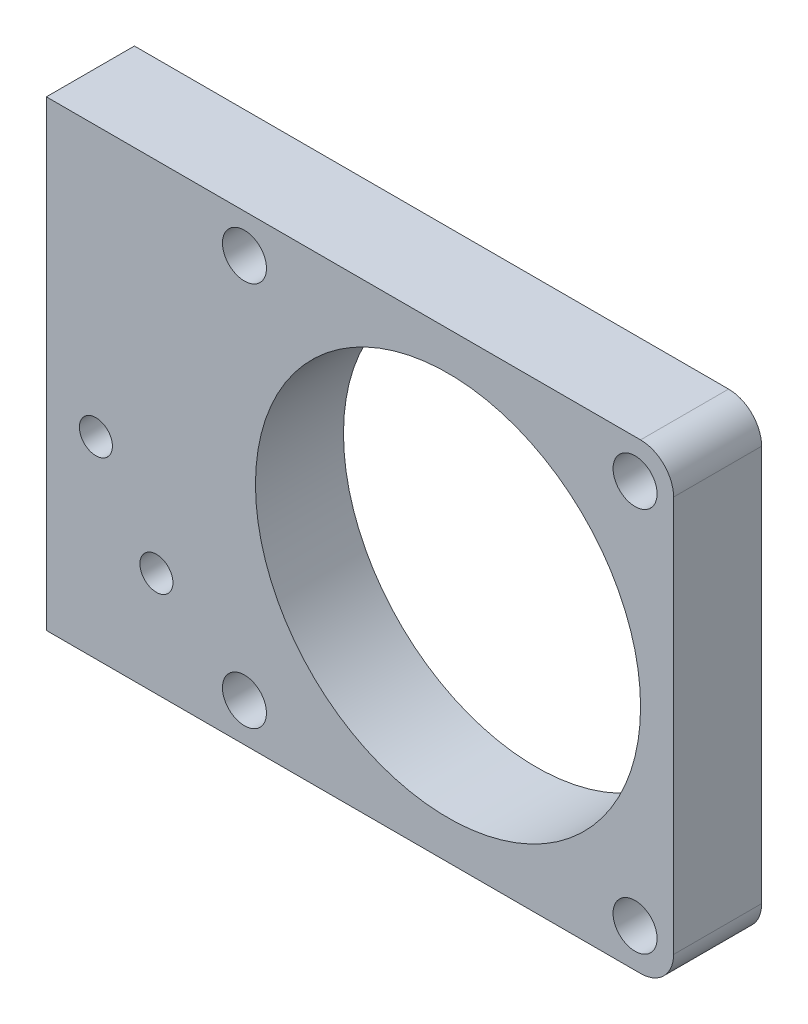
ISO-10303-21;
HEADER;
FILE_DESCRIPTION(('STEP AP214'),'2;1');
FILE_NAME('part.step','',(''),(''),'','','');
FILE_SCHEMA(('AUTOMOTIVE_DESIGN { 1 0 10303 214 1 1 1 1 }'));
ENDSEC;
DATA;
#1=APPLICATION_CONTEXT('core data for automotive mechanical design processes');
#2=APPLICATION_PROTOCOL_DEFINITION('international standard','automotive_design',2000,#1);
#3=PRODUCT_CONTEXT('',#1,'mechanical');
#4=PRODUCT('Part','Part','',(#3));
#5=PRODUCT_RELATED_PRODUCT_CATEGORY('part','',(#4));
#6=PRODUCT_DEFINITION_FORMATION('','',#4);
#7=PRODUCT_DEFINITION_CONTEXT('part definition',#1,'design');
#8=PRODUCT_DEFINITION('design','',#6,#7);
#9=PRODUCT_DEFINITION_SHAPE('','',#8);
#10=(LENGTH_UNIT() NAMED_UNIT(*) SI_UNIT(.MILLI.,.METRE.));
#11=(NAMED_UNIT(*) PLANE_ANGLE_UNIT() SI_UNIT($,.RADIAN.));
#12=(NAMED_UNIT(*) SI_UNIT($,.STERADIAN.) SOLID_ANGLE_UNIT());
#13=UNCERTAINTY_MEASURE_WITH_UNIT(LENGTH_MEASURE(1.E-05),#10,'distance_accuracy_value','');
#14=(GEOMETRIC_REPRESENTATION_CONTEXT(3) GLOBAL_UNCERTAINTY_ASSIGNED_CONTEXT((#13)) GLOBAL_UNIT_ASSIGNED_CONTEXT((#10,
#11,#12)) REPRESENTATION_CONTEXT('',''));
#15=CARTESIAN_POINT('',(0.,0.,0.));
#16=DIRECTION('',(0.,0.,1.));
#17=DIRECTION('',(1.,0.,0.));
#18=AXIS2_PLACEMENT_3D('',#15,#16,#17);
#19=CARTESIAN_POINT('',(28.5,-21.,8.));
#20=DIRECTION('',(-1.,0.,0.));
#21=DIRECTION('',(0.,0.,1.));
#22=AXIS2_PLACEMENT_3D('',#19,#20,#21);
#23=PLANE('',#22);
#24=DIRECTION('',(0.,1.,0.));
#25=VECTOR('',#24,1.);
#26=CARTESIAN_POINT('',(28.5,-21.,0.));
#27=LINE('',#26,#25);
#28=CARTESIAN_POINT('',(28.5,-18.,0.));
#29=VERTEX_POINT('',#28);
#30=CARTESIAN_POINT('',(28.5,18.,0.));
#31=VERTEX_POINT('',#30);
#32=EDGE_CURVE('E125',#29,#31,#27,.T.);
#33=ORIENTED_EDGE('',*,*,#32,.T.);
#34=DIRECTION('',(0.,0.,-1.));
#35=VECTOR('',#34,1.);
#36=CARTESIAN_POINT('',(28.5,18.,8.));
#37=LINE('',#36,#35);
#38=CARTESIAN_POINT('',(28.5,18.,8.));
#39=VERTEX_POINT('',#38);
#40=EDGE_CURVE('E47',#31,#39,#37,.F.);
#41=ORIENTED_EDGE('',*,*,#40,.T.);
#42=DIRECTION('',(0.,1.,0.));
#43=VECTOR('',#42,1.);
#44=CARTESIAN_POINT('',(28.5,-21.,8.));
#45=LINE('',#44,#43);
#46=CARTESIAN_POINT('',(28.5,-18.,8.));
#47=VERTEX_POINT('',#46);
#48=EDGE_CURVE('E103',#47,#39,#45,.T.);
#49=ORIENTED_EDGE('',*,*,#48,.F.);
#50=DIRECTION('',(0.,0.,-1.));
#51=VECTOR('',#50,1.);
#52=CARTESIAN_POINT('',(28.5,-18.,8.));
#53=LINE('',#52,#51);
#54=EDGE_CURVE('E112',#47,#29,#53,.T.);
#55=ORIENTED_EDGE('',*,*,#54,.T.);
#56=EDGE_LOOP('',(#33,#41,#49,#55));
#57=FACE_BOUND('',#56,.T.);
#58=ADVANCED_FACE('F38',(#57),#23,.F.);
#59=CARTESIAN_POINT('',(-28.5,21.,8.));
#60=DIRECTION('',(0.,-1.,0.));
#61=DIRECTION('',(0.,0.,-1.));
#62=AXIS2_PLACEMENT_3D('',#59,#60,#61);
#63=PLANE('',#62);
#64=DIRECTION('',(-1.,0.,0.));
#65=VECTOR('',#64,1.);
#66=CARTESIAN_POINT('',(-28.5,21.,8.));
#67=LINE('',#66,#65);
#68=CARTESIAN_POINT('',(25.5,21.,8.));
#69=VERTEX_POINT('',#68);
#70=CARTESIAN_POINT('',(-28.5,21.,8.));
#71=VERTEX_POINT('',#70);
#72=EDGE_CURVE('E91',#69,#71,#67,.T.);
#73=ORIENTED_EDGE('',*,*,#72,.F.);
#74=DIRECTION('',(0.,0.,-1.));
#75=VECTOR('',#74,1.);
#76=CARTESIAN_POINT('',(25.5,21.,8.));
#77=LINE('',#76,#75);
#78=CARTESIAN_POINT('',(25.5,21.,0.));
#79=VERTEX_POINT('',#78);
#80=EDGE_CURVE('E152',#69,#79,#77,.T.);
#81=ORIENTED_EDGE('',*,*,#80,.T.);
#82=DIRECTION('',(-1.,0.,0.));
#83=VECTOR('',#82,1.);
#84=CARTESIAN_POINT('',(-28.5,21.,0.));
#85=LINE('',#84,#83);
#86=CARTESIAN_POINT('',(-28.5,21.,0.));
#87=VERTEX_POINT('',#86);
#88=EDGE_CURVE('E108',#79,#87,#85,.T.);
#89=ORIENTED_EDGE('',*,*,#88,.T.);
#90=DIRECTION('',(0.,0.,-1.));
#91=VECTOR('',#90,1.);
#92=CARTESIAN_POINT('',(-28.5,21.,8.));
#93=LINE('',#92,#91);
#94=EDGE_CURVE('E106',#71,#87,#93,.T.);
#95=ORIENTED_EDGE('',*,*,#94,.F.);
#96=EDGE_LOOP('',(#73,#81,#89,#95));
#97=FACE_BOUND('',#96,.T.);
#98=ADVANCED_FACE('F107',(#97),#63,.F.);
#99=CARTESIAN_POINT('',(-28.5,-21.,8.));
#100=DIRECTION('',(1.,0.,0.));
#101=DIRECTION('',(0.,0.,-1.));
#102=AXIS2_PLACEMENT_3D('',#99,#100,#101);
#103=PLANE('',#102);
#104=CARTESIAN_POINT('',(-28.5,16.,4.));
#105=DIRECTION('',(-1.,0.,0.));
#106=DIRECTION('',(0.,0.,1.));
#107=AXIS2_PLACEMENT_3D('',#104,#105,#106);
#108=CIRCLE('',#107,2.);
#109=CARTESIAN_POINT('',(-28.5,16.,6.));
#110=VERTEX_POINT('',#109);
#111=EDGE_CURVE('E233',#110,#110,#108,.T.);
#112=ORIENTED_EDGE('',*,*,#111,.F.);
#113=EDGE_LOOP('',(#112));
#114=FACE_BOUND('',#113,.T.);
#115=CARTESIAN_POINT('',(-28.5,-16.,4.00000000000002));
#116=DIRECTION('',(-1.,0.,0.));
#117=DIRECTION('',(0.,0.,-1.));
#118=AXIS2_PLACEMENT_3D('',#115,#116,#117);
#119=CIRCLE('',#118,2.);
#120=CARTESIAN_POINT('',(-28.5,-16.,2.00000000000001));
#121=VERTEX_POINT('',#120);
#122=EDGE_CURVE('E225',#121,#121,#119,.T.);
#123=ORIENTED_EDGE('',*,*,#122,.F.);
#124=EDGE_LOOP('',(#123));
#125=FACE_BOUND('',#124,.T.);
#126=DIRECTION('',(0.,-1.,0.));
#127=VECTOR('',#126,1.);
#128=CARTESIAN_POINT('',(-28.5,-21.,0.));
#129=LINE('',#128,#127);
#130=CARTESIAN_POINT('',(-28.5,-21.,0.));
#131=VERTEX_POINT('',#130);
#132=EDGE_CURVE('E131',#87,#131,#129,.T.);
#133=ORIENTED_EDGE('',*,*,#132,.T.);
#134=DIRECTION('',(0.,0.,-1.));
#135=VECTOR('',#134,1.);
#136=CARTESIAN_POINT('',(-28.5,-21.,8.));
#137=LINE('',#136,#135);
#138=CARTESIAN_POINT('',(-28.5,-21.,8.));
#139=VERTEX_POINT('',#138);
#140=EDGE_CURVE('E113',#139,#131,#137,.T.);
#141=ORIENTED_EDGE('',*,*,#140,.F.);
#142=DIRECTION('',(0.,-1.,0.));
#143=VECTOR('',#142,1.);
#144=CARTESIAN_POINT('',(-28.5,-21.,8.));
#145=LINE('',#144,#143);
#146=EDGE_CURVE('E96',#71,#139,#145,.T.);
#147=ORIENTED_EDGE('',*,*,#146,.F.);
#148=ORIENTED_EDGE('',*,*,#94,.T.);
#149=EDGE_LOOP('',(#133,#141,#147,#148));
#150=FACE_BOUND('',#149,.T.);
#151=ADVANCED_FACE('F115',(#114,#125,#150),#103,.F.);
#152=CARTESIAN_POINT('',(-28.5,-21.,8.));
#153=DIRECTION('',(0.,1.,0.));
#154=DIRECTION('',(0.,0.,1.));
#155=AXIS2_PLACEMENT_3D('',#152,#153,#154);
#156=PLANE('',#155);
#157=DIRECTION('',(1.,0.,0.));
#158=VECTOR('',#157,1.);
#159=CARTESIAN_POINT('',(-28.5,-21.,0.));
#160=LINE('',#159,#158);
#161=CARTESIAN_POINT('',(25.5,-21.,0.));
#162=VERTEX_POINT('',#161);
#163=EDGE_CURVE('E134',#131,#162,#160,.T.);
#164=ORIENTED_EDGE('',*,*,#163,.T.);
#165=DIRECTION('',(0.,0.,-1.));
#166=VECTOR('',#165,1.);
#167=CARTESIAN_POINT('',(25.5,-21.,8.));
#168=LINE('',#167,#166);
#169=CARTESIAN_POINT('',(25.5,-21.,8.));
#170=VERTEX_POINT('',#169);
#171=EDGE_CURVE('E146',#162,#170,#168,.F.);
#172=ORIENTED_EDGE('',*,*,#171,.T.);
#173=DIRECTION('',(1.,0.,0.));
#174=VECTOR('',#173,1.);
#175=CARTESIAN_POINT('',(-28.5,-21.,8.));
#176=LINE('',#175,#174);
#177=EDGE_CURVE('E119',#139,#170,#176,.T.);
#178=ORIENTED_EDGE('',*,*,#177,.F.);
#179=ORIENTED_EDGE('',*,*,#140,.T.);
#180=EDGE_LOOP('',(#164,#172,#178,#179));
#181=FACE_BOUND('',#180,.T.);
#182=ADVANCED_FACE('F161',(#181),#156,.F.);
#183=CARTESIAN_POINT('',(0.,0.,8.));
#184=DIRECTION('',(0.,0.,-1.));
#185=DIRECTION('',(-1.,0.,0.));
#186=AXIS2_PLACEMENT_3D('',#183,#184,#185);
#187=PLANE('',#186);
#188=CARTESIAN_POINT('',(-24.,-3.5,8.));
#189=DIRECTION('',(0.,0.,1.));
#190=DIRECTION('',(1.,0.,0.));
#191=AXIS2_PLACEMENT_3D('',#188,#189,#190);
#192=CIRCLE('',#191,1.5);
#193=CARTESIAN_POINT('',(-22.5,-3.5,8.));
#194=VERTEX_POINT('',#193);
#195=EDGE_CURVE('E177',#194,#194,#192,.T.);
#196=ORIENTED_EDGE('',*,*,#195,.F.);
#197=EDGE_LOOP('',(#196));
#198=FACE_BOUND('',#197,.T.);
#199=CARTESIAN_POINT('',(-18.5,-11.5,8.));
#200=DIRECTION('',(0.,0.,1.));
#201=DIRECTION('',(1.,0.,0.));
#202=AXIS2_PLACEMENT_3D('',#199,#200,#201);
#203=CIRCLE('',#202,1.5);
#204=CARTESIAN_POINT('',(-17.,-11.5,8.));
#205=VERTEX_POINT('',#204);
#206=EDGE_CURVE('E186',#205,#205,#203,.T.);
#207=ORIENTED_EDGE('',*,*,#206,.F.);
#208=EDGE_LOOP('',(#207));
#209=FACE_BOUND('',#208,.T.);
#210=CARTESIAN_POINT('',(-10.5,-17.4999999999998,8.));
#211=DIRECTION('',(0.,0.,1.));
#212=DIRECTION('',(-1.,0.,0.));
#213=AXIS2_PLACEMENT_3D('',#210,#211,#212);
#214=CIRCLE('',#213,2.00000000000001);
#215=CARTESIAN_POINT('',(-12.5,-17.4999999999998,8.));
#216=VERTEX_POINT('',#215);
#217=EDGE_CURVE('E194',#216,#216,#214,.T.);
#218=ORIENTED_EDGE('',*,*,#217,.F.);
#219=EDGE_LOOP('',(#218));
#220=FACE_BOUND('',#219,.T.);
#221=CARTESIAN_POINT('',(25.,-17.5,8.));
#222=DIRECTION('',(0.,0.,1.));
#223=DIRECTION('',(-1.,0.,0.));
#224=AXIS2_PLACEMENT_3D('',#221,#222,#223);
#225=CIRCLE('',#224,2.00000000000001);
#226=CARTESIAN_POINT('',(23.,-17.5,8.));
#227=VERTEX_POINT('',#226);
#228=EDGE_CURVE('E202',#227,#227,#225,.T.);
#229=ORIENTED_EDGE('',*,*,#228,.F.);
#230=EDGE_LOOP('',(#229));
#231=FACE_BOUND('',#230,.T.);
#232=CARTESIAN_POINT('',(-10.5,17.4999999999998,8.));
#233=DIRECTION('',(0.,0.,1.));
#234=DIRECTION('',(1.,0.,0.));
#235=AXIS2_PLACEMENT_3D('',#232,#233,#234);
#236=CIRCLE('',#235,2.00000000000001);
#237=CARTESIAN_POINT('',(-8.5,17.4999999999998,8.));
#238=VERTEX_POINT('',#237);
#239=EDGE_CURVE('E210',#238,#238,#236,.T.);
#240=ORIENTED_EDGE('',*,*,#239,.F.);
#241=EDGE_LOOP('',(#240));
#242=FACE_BOUND('',#241,.T.);
#243=CARTESIAN_POINT('',(25.,17.5,8.));
#244=DIRECTION('',(0.,0.,1.));
#245=DIRECTION('',(1.,0.,0.));
#246=AXIS2_PLACEMENT_3D('',#243,#244,#245);
#247=CIRCLE('',#246,2.00000000000001);
#248=CARTESIAN_POINT('',(27.,17.5,8.));
#249=VERTEX_POINT('',#248);
#250=EDGE_CURVE('E218',#249,#249,#247,.T.);
#251=ORIENTED_EDGE('',*,*,#250,.F.);
#252=EDGE_LOOP('',(#251));
#253=FACE_BOUND('',#252,.T.);
#254=CARTESIAN_POINT('',(7.99999999999984,-4.19977052450181E-12,8.));
#255=DIRECTION('',(0.,0.,1.));
#256=DIRECTION('',(1.,0.,0.));
#257=AXIS2_PLACEMENT_3D('',#254,#255,#256);
#258=CIRCLE('',#257,17.5000000000014);
#259=CARTESIAN_POINT('',(25.5000000000012,-4.19977052450181E-12,8.));
#260=VERTEX_POINT('',#259);
#261=EDGE_CURVE('E169',#260,#260,#258,.T.);
#262=ORIENTED_EDGE('',*,*,#261,.F.);
#263=EDGE_LOOP('',(#262));
#264=FACE_BOUND('',#263,.T.);
#265=ORIENTED_EDGE('',*,*,#48,.T.);
#266=CARTESIAN_POINT('',(25.5,18.,8.));
#267=DIRECTION('',(0.,0.,-1.));
#268=DIRECTION('',(-1.,0.,0.));
#269=AXIS2_PLACEMENT_3D('',#266,#267,#268);
#270=CIRCLE('',#269,3.);
#271=EDGE_CURVE('E11',#39,#69,#270,.F.);
#272=ORIENTED_EDGE('',*,*,#271,.T.);
#273=ORIENTED_EDGE('',*,*,#72,.T.);
#274=ORIENTED_EDGE('',*,*,#146,.T.);
#275=ORIENTED_EDGE('',*,*,#177,.T.);
#276=CARTESIAN_POINT('',(25.5,-18.,8.));
#277=DIRECTION('',(0.,0.,-1.));
#278=DIRECTION('',(-1.,0.,0.));
#279=AXIS2_PLACEMENT_3D('',#276,#277,#278);
#280=CIRCLE('',#279,3.);
#281=EDGE_CURVE('E149',#170,#47,#280,.F.);
#282=ORIENTED_EDGE('',*,*,#281,.T.);
#283=EDGE_LOOP('',(#265,#272,#273,#274,#275,#282));
#284=FACE_BOUND('',#283,.T.);
#285=ADVANCED_FACE('F93',(#198,#209,#220,#231,#242,#253,#264,#284),#187,.F.);
#286=CARTESIAN_POINT('',(0.,0.,0.));
#287=DIRECTION('',(0.,0.,-1.));
#288=DIRECTION('',(-1.,0.,0.));
#289=AXIS2_PLACEMENT_3D('',#286,#287,#288);
#290=PLANE('',#289);
#291=CARTESIAN_POINT('',(-24.,-3.5,0.));
#292=DIRECTION('',(0.,0.,1.));
#293=DIRECTION('',(1.,0.,0.));
#294=AXIS2_PLACEMENT_3D('',#291,#292,#293);
#295=CIRCLE('',#294,1.5);
#296=CARTESIAN_POINT('',(-22.5,-3.5,0.));
#297=VERTEX_POINT('',#296);
#298=EDGE_CURVE('E181',#297,#297,#295,.T.);
#299=ORIENTED_EDGE('',*,*,#298,.T.);
#300=EDGE_LOOP('',(#299));
#301=FACE_BOUND('',#300,.T.);
#302=CARTESIAN_POINT('',(-18.5,-11.5,0.));
#303=DIRECTION('',(0.,0.,1.));
#304=DIRECTION('',(1.,0.,0.));
#305=AXIS2_PLACEMENT_3D('',#302,#303,#304);
#306=CIRCLE('',#305,1.5);
#307=CARTESIAN_POINT('',(-17.,-11.5,0.));
#308=VERTEX_POINT('',#307);
#309=EDGE_CURVE('E190',#308,#308,#306,.T.);
#310=ORIENTED_EDGE('',*,*,#309,.T.);
#311=EDGE_LOOP('',(#310));
#312=FACE_BOUND('',#311,.T.);
#313=CARTESIAN_POINT('',(-10.5,-17.4999999999998,0.));
#314=DIRECTION('',(0.,0.,1.));
#315=DIRECTION('',(-1.,0.,0.));
#316=AXIS2_PLACEMENT_3D('',#313,#314,#315);
#317=CIRCLE('',#316,2.00000000000001);
#318=CARTESIAN_POINT('',(-12.5,-17.4999999999998,0.));
#319=VERTEX_POINT('',#318);
#320=EDGE_CURVE('E198',#319,#319,#317,.T.);
#321=ORIENTED_EDGE('',*,*,#320,.T.);
#322=EDGE_LOOP('',(#321));
#323=FACE_BOUND('',#322,.T.);
#324=CARTESIAN_POINT('',(25.,-17.5,0.));
#325=DIRECTION('',(0.,0.,1.));
#326=DIRECTION('',(-1.,0.,0.));
#327=AXIS2_PLACEMENT_3D('',#324,#325,#326);
#328=CIRCLE('',#327,2.00000000000001);
#329=CARTESIAN_POINT('',(23.,-17.5,0.));
#330=VERTEX_POINT('',#329);
#331=EDGE_CURVE('E206',#330,#330,#328,.T.);
#332=ORIENTED_EDGE('',*,*,#331,.T.);
#333=EDGE_LOOP('',(#332));
#334=FACE_BOUND('',#333,.T.);
#335=CARTESIAN_POINT('',(-10.5,17.4999999999998,0.));
#336=DIRECTION('',(0.,0.,1.));
#337=DIRECTION('',(1.,0.,0.));
#338=AXIS2_PLACEMENT_3D('',#335,#336,#337);
#339=CIRCLE('',#338,2.00000000000001);
#340=CARTESIAN_POINT('',(-8.5,17.4999999999998,0.));
#341=VERTEX_POINT('',#340);
#342=EDGE_CURVE('E214',#341,#341,#339,.T.);
#343=ORIENTED_EDGE('',*,*,#342,.T.);
#344=EDGE_LOOP('',(#343));
#345=FACE_BOUND('',#344,.T.);
#346=CARTESIAN_POINT('',(25.,17.5,0.));
#347=DIRECTION('',(0.,0.,1.));
#348=DIRECTION('',(1.,0.,0.));
#349=AXIS2_PLACEMENT_3D('',#346,#347,#348);
#350=CIRCLE('',#349,2.00000000000001);
#351=CARTESIAN_POINT('',(27.,17.5,0.));
#352=VERTEX_POINT('',#351);
#353=EDGE_CURVE('E173',#352,#352,#350,.T.);
#354=ORIENTED_EDGE('',*,*,#353,.T.);
#355=EDGE_LOOP('',(#354));
#356=FACE_BOUND('',#355,.T.);
#357=CARTESIAN_POINT('',(7.99999999999984,-4.19977052450181E-12,0.));
#358=DIRECTION('',(0.,0.,1.));
#359=DIRECTION('',(1.,0.,0.));
#360=AXIS2_PLACEMENT_3D('',#357,#358,#359);
#361=CIRCLE('',#360,17.5000000000014);
#362=CARTESIAN_POINT('',(25.5000000000012,-4.19977052450181E-12,0.));
#363=VERTEX_POINT('',#362);
#364=EDGE_CURVE('E128',#363,#363,#361,.T.);
#365=ORIENTED_EDGE('',*,*,#364,.T.);
#366=EDGE_LOOP('',(#365));
#367=FACE_BOUND('',#366,.T.);
#368=ORIENTED_EDGE('',*,*,#88,.F.);
#369=CARTESIAN_POINT('',(25.5,18.,0.));
#370=DIRECTION('',(0.,0.,-1.));
#371=DIRECTION('',(-1.,0.,0.));
#372=AXIS2_PLACEMENT_3D('',#369,#370,#371);
#373=CIRCLE('',#372,3.);
#374=EDGE_CURVE('E61',#79,#31,#373,.T.);
#375=ORIENTED_EDGE('',*,*,#374,.T.);
#376=ORIENTED_EDGE('',*,*,#32,.F.);
#377=CARTESIAN_POINT('',(25.5,-18.,0.));
#378=DIRECTION('',(0.,0.,-1.));
#379=DIRECTION('',(-1.,0.,0.));
#380=AXIS2_PLACEMENT_3D('',#377,#378,#379);
#381=CIRCLE('',#380,3.);
#382=EDGE_CURVE('E143',#29,#162,#381,.T.);
#383=ORIENTED_EDGE('',*,*,#382,.T.);
#384=ORIENTED_EDGE('',*,*,#163,.F.);
#385=ORIENTED_EDGE('',*,*,#132,.F.);
#386=EDGE_LOOP('',(#368,#375,#376,#383,#384,#385));
#387=FACE_BOUND('',#386,.T.);
#388=ADVANCED_FACE('F158',(#301,#312,#323,#334,#345,#356,#367,#387),#290,.T.);
#389=CARTESIAN_POINT('',(7.99999999999984,-4.19977052450181E-12,0.));
#390=DIRECTION('',(0.,0.,1.));
#391=DIRECTION('',(1.,0.,0.));
#392=AXIS2_PLACEMENT_3D('',#389,#390,#391);
#393=CYLINDRICAL_SURFACE('',#392,17.5000000000014);
#394=ORIENTED_EDGE('',*,*,#364,.F.);
#395=EDGE_LOOP('',(#394));
#396=FACE_BOUND('',#395,.T.);
#397=ORIENTED_EDGE('',*,*,#261,.T.);
#398=EDGE_LOOP('',(#397));
#399=FACE_BOUND('',#398,.T.);
#400=ADVANCED_FACE('F291',(#396,#399),#393,.F.);
#401=CARTESIAN_POINT('',(25.,17.5,0.));
#402=DIRECTION('',(0.,0.,1.));
#403=DIRECTION('',(1.,0.,0.));
#404=AXIS2_PLACEMENT_3D('',#401,#402,#403);
#405=CYLINDRICAL_SURFACE('',#404,2.00000000000001);
#406=ORIENTED_EDGE('',*,*,#353,.F.);
#407=EDGE_LOOP('',(#406));
#408=FACE_BOUND('',#407,.T.);
#409=ORIENTED_EDGE('',*,*,#250,.T.);
#410=EDGE_LOOP('',(#409));
#411=FACE_BOUND('',#410,.T.);
#412=ADVANCED_FACE('F294',(#408,#411),#405,.F.);
#413=CARTESIAN_POINT('',(-10.5,17.4999999999998,0.));
#414=DIRECTION('',(0.,0.,1.));
#415=DIRECTION('',(1.,0.,0.));
#416=AXIS2_PLACEMENT_3D('',#413,#414,#415);
#417=CYLINDRICAL_SURFACE('',#416,2.00000000000001);
#418=ORIENTED_EDGE('',*,*,#342,.F.);
#419=EDGE_LOOP('',(#418));
#420=FACE_BOUND('',#419,.T.);
#421=ORIENTED_EDGE('',*,*,#239,.T.);
#422=EDGE_LOOP('',(#421));
#423=FACE_BOUND('',#422,.T.);
#424=ADVANCED_FACE('F380',(#420,#423),#417,.F.);
#425=CARTESIAN_POINT('',(25.,-17.5,0.));
#426=DIRECTION('',(0.,0.,1.));
#427=DIRECTION('',(1.,0.,0.));
#428=AXIS2_PLACEMENT_3D('',#425,#426,#427);
#429=CYLINDRICAL_SURFACE('',#428,2.00000000000001);
#430=ORIENTED_EDGE('',*,*,#331,.F.);
#431=EDGE_LOOP('',(#430));
#432=FACE_BOUND('',#431,.T.);
#433=ORIENTED_EDGE('',*,*,#228,.T.);
#434=EDGE_LOOP('',(#433));
#435=FACE_BOUND('',#434,.T.);
#436=ADVANCED_FACE('F387',(#432,#435),#429,.F.);
#437=CARTESIAN_POINT('',(-10.5,-17.4999999999998,0.));
#438=DIRECTION('',(0.,0.,1.));
#439=DIRECTION('',(1.,0.,0.));
#440=AXIS2_PLACEMENT_3D('',#437,#438,#439);
#441=CYLINDRICAL_SURFACE('',#440,2.00000000000001);
#442=ORIENTED_EDGE('',*,*,#320,.F.);
#443=EDGE_LOOP('',(#442));
#444=FACE_BOUND('',#443,.T.);
#445=ORIENTED_EDGE('',*,*,#217,.T.);
#446=EDGE_LOOP('',(#445));
#447=FACE_BOUND('',#446,.T.);
#448=ADVANCED_FACE('F284',(#444,#447),#441,.F.);
#449=CARTESIAN_POINT('',(-18.5,-11.5,0.));
#450=DIRECTION('',(0.,0.,1.));
#451=DIRECTION('',(1.,0.,0.));
#452=AXIS2_PLACEMENT_3D('',#449,#450,#451);
#453=CYLINDRICAL_SURFACE('',#452,1.5);
#454=ORIENTED_EDGE('',*,*,#309,.F.);
#455=EDGE_LOOP('',(#454));
#456=FACE_BOUND('',#455,.T.);
#457=ORIENTED_EDGE('',*,*,#206,.T.);
#458=EDGE_LOOP('',(#457));
#459=FACE_BOUND('',#458,.T.);
#460=ADVANCED_FACE('F278',(#456,#459),#453,.F.);
#461=CARTESIAN_POINT('',(-24.,-3.5,0.));
#462=DIRECTION('',(0.,0.,1.));
#463=DIRECTION('',(1.,0.,0.));
#464=AXIS2_PLACEMENT_3D('',#461,#462,#463);
#465=CYLINDRICAL_SURFACE('',#464,1.5);
#466=ORIENTED_EDGE('',*,*,#298,.F.);
#467=EDGE_LOOP('',(#466));
#468=FACE_BOUND('',#467,.T.);
#469=ORIENTED_EDGE('',*,*,#195,.T.);
#470=EDGE_LOOP('',(#469));
#471=FACE_BOUND('',#470,.T.);
#472=ADVANCED_FACE('F275',(#468,#471),#465,.F.);
#473=CARTESIAN_POINT('',(25.5,-18.,8.));
#474=DIRECTION('',(0.,0.,-1.));
#475=DIRECTION('',(-1.,0.,0.));
#476=AXIS2_PLACEMENT_3D('',#473,#474,#475);
#477=CYLINDRICAL_SURFACE('',#476,3.);
#478=ORIENTED_EDGE('',*,*,#281,.F.);
#479=ORIENTED_EDGE('',*,*,#171,.F.);
#480=ORIENTED_EDGE('',*,*,#382,.F.);
#481=ORIENTED_EDGE('',*,*,#54,.F.);
#482=EDGE_LOOP('',(#478,#479,#480,#481));
#483=FACE_BOUND('',#482,.T.);
#484=ADVANCED_FACE('F166',(#483),#477,.T.);
#485=CARTESIAN_POINT('',(25.5,18.,8.));
#486=DIRECTION('',(0.,0.,-1.));
#487=DIRECTION('',(-1.,0.,0.));
#488=AXIS2_PLACEMENT_3D('',#485,#486,#487);
#489=CYLINDRICAL_SURFACE('',#488,3.);
#490=ORIENTED_EDGE('',*,*,#271,.F.);
#491=ORIENTED_EDGE('',*,*,#40,.F.);
#492=ORIENTED_EDGE('',*,*,#374,.F.);
#493=ORIENTED_EDGE('',*,*,#80,.F.);
#494=EDGE_LOOP('',(#490,#491,#492,#493));
#495=FACE_BOUND('',#494,.T.);
#496=ADVANCED_FACE('F40',(#495),#489,.T.);
#497=CARTESIAN_POINT('',(-15.5,-16.,4.00000000000002));
#498=DIRECTION('',(-1.,0.,0.));
#499=DIRECTION('',(0.,0.,1.));
#500=AXIS2_PLACEMENT_3D('',#497,#498,#499);
#501=CYLINDRICAL_SURFACE('',#500,2.);
#502=CARTESIAN_POINT('',(-15.5,-16.,4.00000000000002));
#503=DIRECTION('',(-1.,0.,0.));
#504=DIRECTION('',(0.,0.,-1.));
#505=AXIS2_PLACEMENT_3D('',#502,#503,#504);
#506=CIRCLE('',#505,2.);
#507=CARTESIAN_POINT('',(-15.5,-16.,2.00000000000001));
#508=VERTEX_POINT('',#507);
#509=EDGE_CURVE('E229',#508,#508,#506,.T.);
#510=ORIENTED_EDGE('',*,*,#509,.F.);
#511=EDGE_LOOP('',(#510));
#512=FACE_BOUND('',#511,.T.);
#513=ORIENTED_EDGE('',*,*,#122,.T.);
#514=EDGE_LOOP('',(#513));
#515=FACE_BOUND('',#514,.T.);
#516=ADVANCED_FACE('F255',(#512,#515),#501,.F.);
#517=CARTESIAN_POINT('',(-15.5,-16.,4.00000000000002));
#518=DIRECTION('',(1.,0.,0.));
#519=DIRECTION('',(0.,0.,-1.));
#520=AXIS2_PLACEMENT_3D('',#517,#518,#519);
#521=PLANE('',#520);
#522=ORIENTED_EDGE('',*,*,#509,.T.);
#523=EDGE_LOOP('',(#522));
#524=FACE_BOUND('',#523,.T.);
#525=ADVANCED_FACE('F246',(#524),#521,.F.);
#526=CARTESIAN_POINT('',(-15.5,16.,4.));
#527=DIRECTION('',(-1.,0.,0.));
#528=DIRECTION('',(0.,0.,1.));
#529=AXIS2_PLACEMENT_3D('',#526,#527,#528);
#530=CYLINDRICAL_SURFACE('',#529,2.);
#531=CARTESIAN_POINT('',(-15.5,16.,4.));
#532=DIRECTION('',(-1.,0.,0.));
#533=DIRECTION('',(0.,0.,1.));
#534=AXIS2_PLACEMENT_3D('',#531,#532,#533);
#535=CIRCLE('',#534,2.);
#536=CARTESIAN_POINT('',(-15.5,16.,6.));
#537=VERTEX_POINT('',#536);
#538=EDGE_CURVE('E182',#537,#537,#535,.T.);
#539=ORIENTED_EDGE('',*,*,#538,.F.);
#540=EDGE_LOOP('',(#539));
#541=FACE_BOUND('',#540,.T.);
#542=ORIENTED_EDGE('',*,*,#111,.T.);
#543=EDGE_LOOP('',(#542));
#544=FACE_BOUND('',#543,.T.);
#545=ADVANCED_FACE('F243',(#541,#544),#530,.F.);
#546=CARTESIAN_POINT('',(-15.5,16.,4.));
#547=DIRECTION('',(-1.,0.,0.));
#548=DIRECTION('',(0.,0.,1.));
#549=AXIS2_PLACEMENT_3D('',#546,#547,#548);
#550=PLANE('',#549);
#551=ORIENTED_EDGE('',*,*,#538,.T.);
#552=EDGE_LOOP('',(#551));
#553=FACE_BOUND('',#552,.T.);
#554=ADVANCED_FACE('F241',(#553),#550,.T.);
#555=CLOSED_SHELL('',(#58,#98,#151,#182,#285,#388,#400,#412,#424,#436,#448,#460,#472,#484,#496,
#516,#525,#545,#554));
#556=MANIFOLD_SOLID_BREP('B2',#555);
#557=ADVANCED_BREP_SHAPE_REPRESENTATION('',(#18,#556),#14);
#558=SHAPE_DEFINITION_REPRESENTATION(#9,#557);
ENDSEC;
END-ISO-10303-21;
